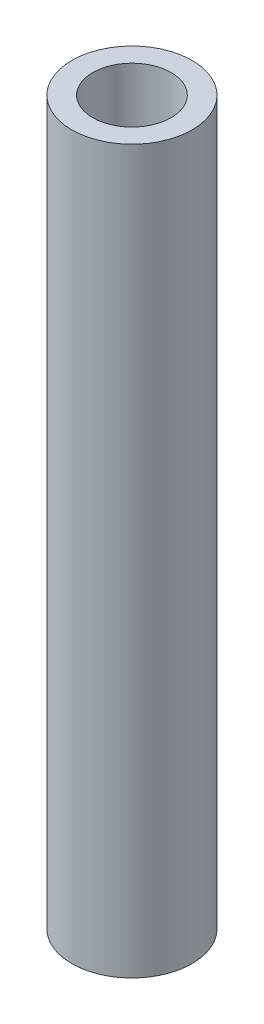
ISO-10303-21;
HEADER;
FILE_DESCRIPTION(('STEP AP214'),'2;1');
FILE_NAME('part.step','',(''),(''),'','','');
FILE_SCHEMA(('AUTOMOTIVE_DESIGN { 1 0 10303 214 1 1 1 1 }'));
ENDSEC;
DATA;
#1=APPLICATION_CONTEXT('core data for automotive mechanical design processes');
#2=APPLICATION_PROTOCOL_DEFINITION('international standard','automotive_design',2000,#1);
#3=PRODUCT_CONTEXT('',#1,'mechanical');
#4=PRODUCT('Part','Part','',(#3));
#5=PRODUCT_RELATED_PRODUCT_CATEGORY('part','',(#4));
#6=PRODUCT_DEFINITION_FORMATION('','',#4);
#7=PRODUCT_DEFINITION_CONTEXT('part definition',#1,'design');
#8=PRODUCT_DEFINITION('design','',#6,#7);
#9=PRODUCT_DEFINITION_SHAPE('','',#8);
#10=(LENGTH_UNIT() NAMED_UNIT(*) SI_UNIT(.MILLI.,.METRE.));
#11=(NAMED_UNIT(*) PLANE_ANGLE_UNIT() SI_UNIT($,.RADIAN.));
#12=(NAMED_UNIT(*) SI_UNIT($,.STERADIAN.) SOLID_ANGLE_UNIT());
#13=UNCERTAINTY_MEASURE_WITH_UNIT(LENGTH_MEASURE(1.E-05),#10,'distance_accuracy_value','');
#14=(GEOMETRIC_REPRESENTATION_CONTEXT(3) GLOBAL_UNCERTAINTY_ASSIGNED_CONTEXT((#13)) GLOBAL_UNIT_ASSIGNED_CONTEXT((#10,
#11,#12)) REPRESENTATION_CONTEXT('',''));
#15=CARTESIAN_POINT('',(0.,0.,0.));
#16=DIRECTION('',(0.,0.,1.));
#17=DIRECTION('',(1.,0.,0.));
#18=AXIS2_PLACEMENT_3D('',#15,#16,#17);
#19=CARTESIAN_POINT('',(0.,57.15,0.));
#20=DIRECTION('',(0.,1.,0.));
#21=DIRECTION('',(0.,0.,1.));
#22=AXIS2_PLACEMENT_3D('',#19,#20,#21);
#23=PLANE('',#22);
#24=CARTESIAN_POINT('',(0.,57.15,0.));
#25=DIRECTION('',(0.,1.,0.));
#26=DIRECTION('',(0.,0.,1.));
#27=AXIS2_PLACEMENT_3D('',#24,#25,#26);
#28=CIRCLE('',#27,4.7625);
#29=CARTESIAN_POINT('',(0.,57.15,4.7625));
#30=VERTEX_POINT('',#29);
#31=EDGE_CURVE('E10',#30,#30,#28,.T.);
#32=ORIENTED_EDGE('',*,*,#31,.T.);
#33=EDGE_LOOP('',(#32));
#34=FACE_BOUND('',#33,.T.);
#35=CARTESIAN_POINT('',(0.,57.15,0.));
#36=DIRECTION('',(0.,1.,0.));
#37=DIRECTION('',(0.,0.,1.));
#38=AXIS2_PLACEMENT_3D('',#35,#36,#37);
#39=CIRCLE('',#38,3.1);
#40=CARTESIAN_POINT('',(0.,57.15,3.1));
#41=VERTEX_POINT('',#40);
#42=EDGE_CURVE('E42',#41,#41,#39,.T.);
#43=ORIENTED_EDGE('',*,*,#42,.F.);
#44=EDGE_LOOP('',(#43));
#45=FACE_BOUND('',#44,.T.);
#46=ADVANCED_FACE('F31',(#34,#45),#23,.T.);
#47=CARTESIAN_POINT('',(0.,0.,0.));
#48=DIRECTION('',(0.,1.,0.));
#49=DIRECTION('',(0.,0.,1.));
#50=AXIS2_PLACEMENT_3D('',#47,#48,#49);
#51=PLANE('',#50);
#52=CARTESIAN_POINT('',(0.,0.,0.));
#53=DIRECTION('',(0.,1.,0.));
#54=DIRECTION('',(0.,0.,1.));
#55=AXIS2_PLACEMENT_3D('',#52,#53,#54);
#56=CIRCLE('',#55,4.7625);
#57=CARTESIAN_POINT('',(0.,0.,4.7625));
#58=VERTEX_POINT('',#57);
#59=EDGE_CURVE('E35',#58,#58,#56,.T.);
#60=ORIENTED_EDGE('',*,*,#59,.F.);
#61=EDGE_LOOP('',(#60));
#62=FACE_BOUND('',#61,.T.);
#63=CARTESIAN_POINT('',(0.,0.,0.));
#64=DIRECTION('',(0.,1.,0.));
#65=DIRECTION('',(0.,0.,1.));
#66=AXIS2_PLACEMENT_3D('',#63,#64,#65);
#67=CIRCLE('',#66,3.1);
#68=CARTESIAN_POINT('',(0.,0.,3.1));
#69=VERTEX_POINT('',#68);
#70=EDGE_CURVE('E44',#69,#69,#67,.T.);
#71=ORIENTED_EDGE('',*,*,#70,.T.);
#72=EDGE_LOOP('',(#71));
#73=FACE_BOUND('',#72,.T.);
#74=ADVANCED_FACE('F54',(#62,#73),#51,.F.);
#75=CARTESIAN_POINT('',(0.,57.15,0.));
#76=DIRECTION('',(0.,-1.,0.));
#77=DIRECTION('',(0.,0.,-1.));
#78=AXIS2_PLACEMENT_3D('',#75,#76,#77);
#79=CYLINDRICAL_SURFACE('',#78,4.7625);
#80=ORIENTED_EDGE('',*,*,#31,.F.);
#81=EDGE_LOOP('',(#80));
#82=FACE_BOUND('',#81,.T.);
#83=ORIENTED_EDGE('',*,*,#59,.T.);
#84=EDGE_LOOP('',(#83));
#85=FACE_BOUND('',#84,.T.);
#86=ADVANCED_FACE('F33',(#82,#85),#79,.T.);
#87=CARTESIAN_POINT('',(0.,57.15,0.));
#88=DIRECTION('',(0.,-1.,0.));
#89=DIRECTION('',(0.,0.,-1.));
#90=AXIS2_PLACEMENT_3D('',#87,#88,#89);
#91=CYLINDRICAL_SURFACE('',#90,3.1);
#92=ORIENTED_EDGE('',*,*,#42,.T.);
#93=EDGE_LOOP('',(#92));
#94=FACE_BOUND('',#93,.T.);
#95=ORIENTED_EDGE('',*,*,#70,.F.);
#96=EDGE_LOOP('',(#95));
#97=FACE_BOUND('',#96,.T.);
#98=ADVANCED_FACE('F50',(#94,#97),#91,.F.);
#99=CLOSED_SHELL('',(#46,#74,#86,#98));
#100=MANIFOLD_SOLID_BREP('B2',#99);
#101=ADVANCED_BREP_SHAPE_REPRESENTATION('',(#18,#100),#14);
#102=SHAPE_DEFINITION_REPRESENTATION(#9,#101);
ENDSEC;
END-ISO-10303-21;
